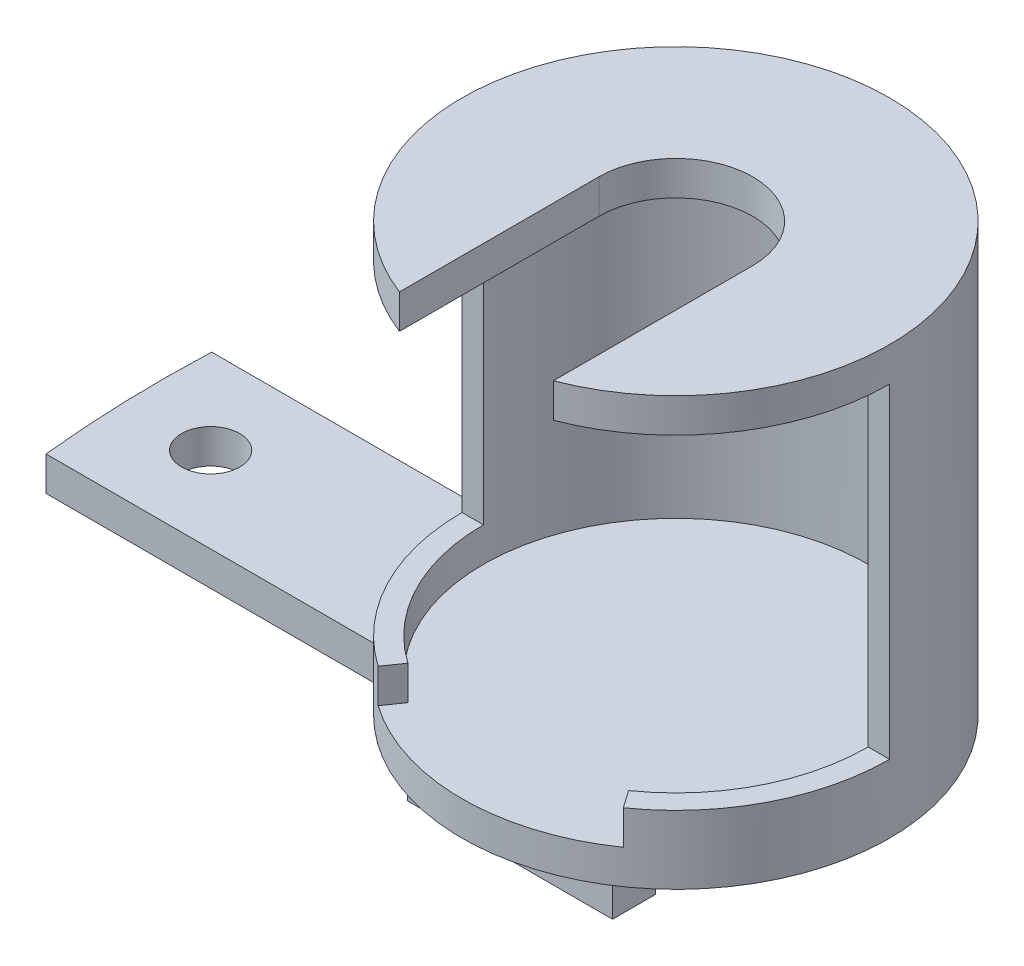
ISO-10303-21;
HEADER;
FILE_DESCRIPTION(('STEP AP214'),'2;1');
FILE_NAME('part.step','',(''),(''),'','','');
FILE_SCHEMA(('AUTOMOTIVE_DESIGN { 1 0 10303 214 1 1 1 1 }'));
ENDSEC;
DATA;
#1=APPLICATION_CONTEXT('core data for automotive mechanical design processes');
#2=APPLICATION_PROTOCOL_DEFINITION('international standard','automotive_design',2000,#1);
#3=PRODUCT_CONTEXT('',#1,'mechanical');
#4=PRODUCT('Part','Part','',(#3));
#5=PRODUCT_RELATED_PRODUCT_CATEGORY('part','',(#4));
#6=PRODUCT_DEFINITION_FORMATION('','',#4);
#7=PRODUCT_DEFINITION_CONTEXT('part definition',#1,'design');
#8=PRODUCT_DEFINITION('design','',#6,#7);
#9=PRODUCT_DEFINITION_SHAPE('','',#8);
#10=(LENGTH_UNIT() NAMED_UNIT(*) SI_UNIT(.MILLI.,.METRE.));
#11=(NAMED_UNIT(*) PLANE_ANGLE_UNIT() SI_UNIT($,.RADIAN.));
#12=(NAMED_UNIT(*) SI_UNIT($,.STERADIAN.) SOLID_ANGLE_UNIT());
#13=UNCERTAINTY_MEASURE_WITH_UNIT(LENGTH_MEASURE(1.E-05),#10,'distance_accuracy_value','');
#14=(GEOMETRIC_REPRESENTATION_CONTEXT(3) GLOBAL_UNCERTAINTY_ASSIGNED_CONTEXT((#13)) GLOBAL_UNIT_ASSIGNED_CONTEXT((#10,
#11,#12)) REPRESENTATION_CONTEXT('',''));
#15=CARTESIAN_POINT('',(0.,0.,0.));
#16=DIRECTION('',(0.,0.,1.));
#17=DIRECTION('',(1.,0.,0.));
#18=AXIS2_PLACEMENT_3D('',#15,#16,#17);
#19=CARTESIAN_POINT('',(0.,-2.,0.));
#20=DIRECTION('',(0.,-1.,0.));
#21=DIRECTION('',(0.,0.,-1.));
#22=AXIS2_PLACEMENT_3D('',#19,#20,#21);
#23=PLANE('',#22);
#24=CARTESIAN_POINT('',(0.,-2.,0.));
#25=DIRECTION('',(0.,-1.,0.));
#26=DIRECTION('',(0.,0.,-1.));
#27=AXIS2_PLACEMENT_3D('',#24,#25,#26);
#28=CIRCLE('',#27,12.5);
#29=CARTESIAN_POINT('',(-12.1823643025482,-2.,-2.8));
#30=VERTEX_POINT('',#29);
#31=CARTESIAN_POINT('',(-10.2181211580212,-2.00000000000001,7.2));
#32=VERTEX_POINT('',#31);
#33=EDGE_CURVE('E395',#30,#32,#28,.T.);
#34=ORIENTED_EDGE('',*,*,#33,.T.);
#35=DIRECTION('',(1.,0.,0.));
#36=VECTOR('',#35,1.);
#37=CARTESIAN_POINT('',(-29.6287297026163,-2.,7.2));
#38=LINE('',#37,#36);
#39=CARTESIAN_POINT('',(-29.6287297026163,-2.,7.2));
#40=VERTEX_POINT('',#39);
#41=EDGE_CURVE('E300',#40,#32,#38,.T.);
#42=ORIENTED_EDGE('',*,*,#41,.F.);
#43=CARTESIAN_POINT('',(40.,-2.,0.));
#44=DIRECTION('',(0.,-1.,0.));
#45=DIRECTION('',(0.,0.,-1.));
#46=AXIS2_PLACEMENT_3D('',#43,#44,#45);
#47=CIRCLE('',#46,70.);
#48=CARTESIAN_POINT('',(-29.9439775820621,-2.,-2.8));
#49=VERTEX_POINT('',#48);
#50=EDGE_CURVE('E274',#49,#40,#47,.F.);
#51=ORIENTED_EDGE('',*,*,#50,.F.);
#52=DIRECTION('',(-1.,0.,0.));
#53=VECTOR('',#52,1.);
#54=CARTESIAN_POINT('',(-29.9439775820621,-2.,-2.8));
#55=LINE('',#54,#53);
#56=EDGE_CURVE('E308',#30,#49,#55,.T.);
#57=ORIENTED_EDGE('',*,*,#56,.F.);
#58=EDGE_LOOP('',(#34,#42,#51,#57));
#59=FACE_BOUND('',#58,.T.);
#60=CARTESIAN_POINT('',(-25.,-2.,2.2));
#61=DIRECTION('',(0.,-1.,0.));
#62=DIRECTION('',(0.,0.,-1.));
#63=AXIS2_PLACEMENT_3D('',#60,#61,#62);
#64=CIRCLE('',#63,1.7);
#65=CARTESIAN_POINT('',(-25.,-2.,0.5));
#66=VERTEX_POINT('',#65);
#67=EDGE_CURVE('E279',#66,#66,#64,.F.);
#68=ORIENTED_EDGE('',*,*,#67,.T.);
#69=EDGE_LOOP('',(#68));
#70=FACE_BOUND('',#69,.T.);
#71=DIRECTION('',(-1.,0.,0.));
#72=VECTOR('',#71,1.);
#73=CARTESIAN_POINT('',(-6.,-2.,9.7));
#74=LINE('',#73,#72);
#75=CARTESIAN_POINT('',(6.,-2.,9.7));
#76=VERTEX_POINT('',#75);
#77=CARTESIAN_POINT('',(-6.,-2.,9.7));
#78=VERTEX_POINT('',#77);
#79=EDGE_CURVE('E235',#76,#78,#74,.T.);
#80=ORIENTED_EDGE('',*,*,#79,.F.);
#81=DIRECTION('',(0.,0.,1.));
#82=VECTOR('',#81,1.);
#83=CARTESIAN_POINT('',(6.,-2.,9.7));
#84=LINE('',#83,#82);
#85=CARTESIAN_POINT('',(6.,-2.,7.2));
#86=VERTEX_POINT('',#85);
#87=EDGE_CURVE('E230',#86,#76,#84,.T.);
#88=ORIENTED_EDGE('',*,*,#87,.F.);
#89=DIRECTION('',(1.,0.,0.));
#90=VECTOR('',#89,1.);
#91=CARTESIAN_POINT('',(-6.,-2.,7.2));
#92=LINE('',#91,#90);
#93=CARTESIAN_POINT('',(-6.,-2.,7.2));
#94=VERTEX_POINT('',#93);
#95=EDGE_CURVE('E245',#94,#86,#92,.T.);
#96=ORIENTED_EDGE('',*,*,#95,.F.);
#97=DIRECTION('',(0.,0.,-1.));
#98=VECTOR('',#97,1.);
#99=CARTESIAN_POINT('',(-6.,-2.,9.7));
#100=LINE('',#99,#98);
#101=EDGE_CURVE('E257',#78,#94,#100,.T.);
#102=ORIENTED_EDGE('',*,*,#101,.F.);
#103=EDGE_LOOP('',(#80,#88,#96,#102));
#104=FACE_BOUND('',#103,.T.);
#105=DIRECTION('',(-1.,0.,0.));
#106=VECTOR('',#105,1.);
#107=CARTESIAN_POINT('',(-6.,-2.,-2.8));
#108=LINE('',#107,#106);
#109=CARTESIAN_POINT('',(6.,-2.,-2.8));
#110=VERTEX_POINT('',#109);
#111=CARTESIAN_POINT('',(-6.,-2.,-2.8));
#112=VERTEX_POINT('',#111);
#113=EDGE_CURVE('E755',#110,#112,#108,.T.);
#114=ORIENTED_EDGE('',*,*,#113,.F.);
#115=DIRECTION('',(0.,0.,1.));
#116=VECTOR('',#115,1.);
#117=CARTESIAN_POINT('',(6.,-2.,-2.8));
#118=LINE('',#117,#116);
#119=CARTESIAN_POINT('',(6.,-2.,-5.3));
#120=VERTEX_POINT('',#119);
#121=EDGE_CURVE('E227',#120,#110,#118,.T.);
#122=ORIENTED_EDGE('',*,*,#121,.F.);
#123=DIRECTION('',(1.,0.,0.));
#124=VECTOR('',#123,1.);
#125=CARTESIAN_POINT('',(-6.,-2.,-5.3));
#126=LINE('',#125,#124);
#127=CARTESIAN_POINT('',(-6.,-2.,-5.3));
#128=VERTEX_POINT('',#127);
#129=EDGE_CURVE('E223',#128,#120,#126,.T.);
#130=ORIENTED_EDGE('',*,*,#129,.F.);
#131=DIRECTION('',(0.,0.,-1.));
#132=VECTOR('',#131,1.);
#133=CARTESIAN_POINT('',(-6.,-2.,-2.8));
#134=LINE('',#133,#132);
#135=EDGE_CURVE('E751',#112,#128,#134,.T.);
#136=ORIENTED_EDGE('',*,*,#135,.F.);
#137=EDGE_LOOP('',(#114,#122,#130,#136));
#138=FACE_BOUND('',#137,.T.);
#139=ADVANCED_FACE('F39',(#59,#70,#104,#138),#23,.T.);
#140=CARTESIAN_POINT('',(0.,2.,0.));
#141=DIRECTION('',(0.,1.,0.));
#142=DIRECTION('',(0.,0.,1.));
#143=AXIS2_PLACEMENT_3D('',#140,#141,#142);
#144=PLANE('',#143);
#145=DIRECTION('',(-0.573576436351047,0.,0.819152044288991));
#146=VECTOR('',#145,1.);
#147=CARTESIAN_POINT('',(0.,2.,0.));
#148=LINE('',#147,#146);
#149=CARTESIAN_POINT('',(-6.45273490894928,2.,9.21546049825115));
#150=VERTEX_POINT('',#149);
#151=CARTESIAN_POINT('',(-7.16970545438809,2.,10.2394005536124));
#152=VERTEX_POINT('',#151);
#153=EDGE_CURVE('E322',#150,#152,#148,.T.);
#154=ORIENTED_EDGE('',*,*,#153,.F.);
#155=CARTESIAN_POINT('',(0.,2.,0.));
#156=DIRECTION('',(0.,1.,0.));
#157=DIRECTION('',(0.,0.,1.));
#158=AXIS2_PLACEMENT_3D('',#155,#156,#157);
#159=CIRCLE('',#158,11.25);
#160=CARTESIAN_POINT('',(-11.25,2.,0.));
#161=VERTEX_POINT('',#160);
#162=EDGE_CURVE('E431',#161,#150,#159,.T.);
#163=ORIENTED_EDGE('',*,*,#162,.F.);
#164=DIRECTION('',(-1.,0.,0.));
#165=VECTOR('',#164,1.);
#166=CARTESIAN_POINT('',(-12.5,2.,0.));
#167=LINE('',#166,#165);
#168=CARTESIAN_POINT('',(-12.5,2.,0.));
#169=VERTEX_POINT('',#168);
#170=EDGE_CURVE('E404',#161,#169,#167,.T.);
#171=ORIENTED_EDGE('',*,*,#170,.T.);
#172=CARTESIAN_POINT('',(0.,2.,0.));
#173=DIRECTION('',(0.,1.,0.));
#174=DIRECTION('',(0.,0.,1.));
#175=AXIS2_PLACEMENT_3D('',#172,#173,#174);
#176=CIRCLE('',#175,12.5);
#177=EDGE_CURVE('E400',#169,#152,#176,.T.);
#178=ORIENTED_EDGE('',*,*,#177,.T.);
#179=EDGE_LOOP('',(#154,#163,#171,#178));
#180=FACE_BOUND('',#179,.T.);
#181=ADVANCED_FACE('F493',(#180),#144,.T.);
#182=CARTESIAN_POINT('',(0.,21.,0.));
#183=DIRECTION('',(0.,-1.,0.));
#184=DIRECTION('',(0.,0.,-1.));
#185=AXIS2_PLACEMENT_3D('',#182,#183,#184);
#186=CYLINDRICAL_SURFACE('',#185,12.5);
#187=ORIENTED_EDGE('',*,*,#33,.F.);
#188=DIRECTION('',(0.,1.,0.));
#189=VECTOR('',#188,1.);
#190=CARTESIAN_POINT('',(-12.1823643025482,-24.1658009221126,-2.8));
#191=LINE('',#190,#189);
#192=CARTESIAN_POINT('',(-12.1823643025482,0.,-2.8));
#193=VERTEX_POINT('',#192);
#194=EDGE_CURVE('E303',#30,#193,#191,.T.);
#195=ORIENTED_EDGE('',*,*,#194,.T.);
#196=CARTESIAN_POINT('',(0.,0.,0.));
#197=DIRECTION('',(0.,-1.,0.));
#198=DIRECTION('',(0.,0.,1.));
#199=AXIS2_PLACEMENT_3D('',#196,#197,#198);
#200=CIRCLE('',#199,12.5);
#201=CARTESIAN_POINT('',(-10.2181211580212,0.,7.2));
#202=VERTEX_POINT('',#201);
#203=EDGE_CURVE('E280',#202,#193,#200,.T.);
#204=ORIENTED_EDGE('',*,*,#203,.F.);
#205=DIRECTION('',(0.,1.,0.));
#206=VECTOR('',#205,1.);
#207=CARTESIAN_POINT('',(-10.2181211580212,-24.1658009221126,7.2));
#208=LINE('',#207,#206);
#209=EDGE_CURVE('E295',#32,#202,#208,.T.);
#210=ORIENTED_EDGE('',*,*,#209,.F.);
#211=EDGE_LOOP('',(#187,#195,#204,#210));
#212=FACE_BOUND('',#211,.T.);
#213=CARTESIAN_POINT('',(0.,0.,0.));
#214=DIRECTION('',(0.,-1.,0.));
#215=DIRECTION('',(0.,0.,-1.));
#216=AXIS2_PLACEMENT_3D('',#213,#214,#215);
#217=CIRCLE('',#216,12.5);
#218=CARTESIAN_POINT('',(-7.16970545438809,0.,10.2394005536124));
#219=VERTEX_POINT('',#218);
#220=CARTESIAN_POINT('',(7.1697054543881,0.,10.2394005536124));
#221=VERTEX_POINT('',#220);
#222=EDGE_CURVE('E337',#219,#221,#217,.F.);
#223=ORIENTED_EDGE('',*,*,#222,.F.);
#224=DIRECTION('',(0.,1.,0.));
#225=VECTOR('',#224,1.);
#226=CARTESIAN_POINT('',(-7.16970545438809,-19.0228469270698,10.2394005536124));
#227=LINE('',#226,#225);
#228=EDGE_CURVE('E330',#219,#152,#227,.T.);
#229=ORIENTED_EDGE('',*,*,#228,.T.);
#230=ORIENTED_EDGE('',*,*,#177,.F.);
#231=DIRECTION('',(0.,1.,0.));
#232=VECTOR('',#231,1.);
#233=CARTESIAN_POINT('',(-12.5,2.,0.));
#234=LINE('',#233,#232);
#235=CARTESIAN_POINT('',(-12.5,21.,0.));
#236=VERTEX_POINT('',#235);
#237=EDGE_CURVE('E415',#169,#236,#234,.T.);
#238=ORIENTED_EDGE('',*,*,#237,.T.);
#239=CARTESIAN_POINT('',(0.,21.,0.));
#240=DIRECTION('',(0.,1.,0.));
#241=DIRECTION('',(0.,0.,1.));
#242=AXIS2_PLACEMENT_3D('',#239,#240,#241);
#243=CIRCLE('',#242,12.5);
#244=CARTESIAN_POINT('',(-4.5,21.,11.6619037896906));
#245=VERTEX_POINT('',#244);
#246=EDGE_CURVE('E373',#236,#245,#243,.T.);
#247=ORIENTED_EDGE('',*,*,#246,.T.);
#248=DIRECTION('',(0.,-1.,0.));
#249=VECTOR('',#248,1.);
#250=CARTESIAN_POINT('',(-4.5,23.,11.6619037896906));
#251=LINE('',#250,#249);
#252=CARTESIAN_POINT('',(-4.5,23.,11.6619037896906));
#253=VERTEX_POINT('',#252);
#254=EDGE_CURVE('E383',#253,#245,#251,.T.);
#255=ORIENTED_EDGE('',*,*,#254,.F.);
#256=CARTESIAN_POINT('',(0.,23.,0.));
#257=DIRECTION('',(0.,1.,0.));
#258=DIRECTION('',(0.,0.,1.));
#259=AXIS2_PLACEMENT_3D('',#256,#257,#258);
#260=CIRCLE('',#259,12.5);
#261=CARTESIAN_POINT('',(4.5,23.,11.6619037896906));
#262=VERTEX_POINT('',#261);
#263=EDGE_CURVE('E360',#262,#253,#260,.T.);
#264=ORIENTED_EDGE('',*,*,#263,.F.);
#265=DIRECTION('',(0.,-1.,0.));
#266=VECTOR('',#265,1.);
#267=CARTESIAN_POINT('',(4.5,23.,11.6619037896906));
#268=LINE('',#267,#266);
#269=CARTESIAN_POINT('',(4.5,21.,11.6619037896906));
#270=VERTEX_POINT('',#269);
#271=EDGE_CURVE('E387',#262,#270,#268,.T.);
#272=ORIENTED_EDGE('',*,*,#271,.T.);
#273=CARTESIAN_POINT('',(12.5,21.,0.));
#274=VERTEX_POINT('',#273);
#275=EDGE_CURVE('E374',#270,#274,#243,.T.);
#276=ORIENTED_EDGE('',*,*,#275,.T.);
#277=DIRECTION('',(0.,1.,0.));
#278=VECTOR('',#277,1.);
#279=CARTESIAN_POINT('',(12.5,2.,0.));
#280=LINE('',#279,#278);
#281=CARTESIAN_POINT('',(12.5,2.,0.));
#282=VERTEX_POINT('',#281);
#283=EDGE_CURVE('E410',#282,#274,#280,.T.);
#284=ORIENTED_EDGE('',*,*,#283,.F.);
#285=CARTESIAN_POINT('',(7.16970545438809,2.,10.2394005536124));
#286=VERTEX_POINT('',#285);
#287=EDGE_CURVE('E405',#286,#282,#176,.T.);
#288=ORIENTED_EDGE('',*,*,#287,.F.);
#289=DIRECTION('',(0.,1.,0.));
#290=VECTOR('',#289,1.);
#291=CARTESIAN_POINT('',(7.1697054543881,-19.0228469270698,10.2394005536124));
#292=LINE('',#291,#290);
#293=EDGE_CURVE('E336',#221,#286,#292,.T.);
#294=ORIENTED_EDGE('',*,*,#293,.F.);
#295=EDGE_LOOP('',(#223,#229,#230,#238,#247,#255,#264,#272,#276,#284,#288,#294));
#296=FACE_BOUND('',#295,.T.);
#297=ADVANCED_FACE('F41',(#212,#296),#186,.T.);
#298=CARTESIAN_POINT('',(0.,21.,0.));
#299=DIRECTION('',(0.,-1.,0.));
#300=DIRECTION('',(0.,0.,-1.));
#301=AXIS2_PLACEMENT_3D('',#298,#299,#300);
#302=CYLINDRICAL_SURFACE('',#301,11.25);
#303=DIRECTION('',(0.,-1.,0.));
#304=VECTOR('',#303,1.);
#305=CARTESIAN_POINT('',(-6.45273490894928,21.,9.21546049825115));
#306=LINE('',#305,#304);
#307=CARTESIAN_POINT('',(-6.45273490894929,0.,9.21546049825115));
#308=VERTEX_POINT('',#307);
#309=EDGE_CURVE('E348',#308,#150,#306,.F.);
#310=ORIENTED_EDGE('',*,*,#309,.F.);
#311=CARTESIAN_POINT('',(0.,0.,0.));
#312=DIRECTION('',(0.,1.,0.));
#313=DIRECTION('',(0.,0.,1.));
#314=AXIS2_PLACEMENT_3D('',#311,#312,#313);
#315=CIRCLE('',#314,11.25);
#316=CARTESIAN_POINT('',(6.45273490894929,0.,9.21546049825115));
#317=VERTEX_POINT('',#316);
#318=EDGE_CURVE('E419',#317,#308,#315,.T.);
#319=ORIENTED_EDGE('',*,*,#318,.F.);
#320=DIRECTION('',(0.,-1.,0.));
#321=VECTOR('',#320,1.);
#322=CARTESIAN_POINT('',(6.45273490894928,21.,9.21546049825115));
#323=LINE('',#322,#321);
#324=CARTESIAN_POINT('',(6.45273490894928,2.,9.21546049825115));
#325=VERTEX_POINT('',#324);
#326=EDGE_CURVE('E335',#325,#317,#323,.T.);
#327=ORIENTED_EDGE('',*,*,#326,.F.);
#328=CARTESIAN_POINT('',(11.25,2.,0.));
#329=VERTEX_POINT('',#328);
#330=EDGE_CURVE('E427',#325,#329,#159,.T.);
#331=ORIENTED_EDGE('',*,*,#330,.T.);
#332=DIRECTION('',(0.,-1.,0.));
#333=VECTOR('',#332,1.);
#334=CARTESIAN_POINT('',(11.25,21.,0.));
#335=LINE('',#334,#333);
#336=CARTESIAN_POINT('',(11.25,21.,0.));
#337=VERTEX_POINT('',#336);
#338=EDGE_CURVE('E11',#337,#329,#335,.T.);
#339=ORIENTED_EDGE('',*,*,#338,.F.);
#340=CARTESIAN_POINT('',(0.,21.,0.));
#341=DIRECTION('',(0.,1.,0.));
#342=DIRECTION('',(0.,0.,1.));
#343=AXIS2_PLACEMENT_3D('',#340,#341,#342);
#344=CIRCLE('',#343,11.25);
#345=CARTESIAN_POINT('',(-11.25,21.,0.));
#346=VERTEX_POINT('',#345);
#347=EDGE_CURVE('E423',#337,#346,#344,.T.);
#348=ORIENTED_EDGE('',*,*,#347,.T.);
#349=DIRECTION('',(0.,-1.,0.));
#350=VECTOR('',#349,1.);
#351=CARTESIAN_POINT('',(-11.25,21.,0.));
#352=LINE('',#351,#350);
#353=EDGE_CURVE('E48',#161,#346,#352,.F.);
#354=ORIENTED_EDGE('',*,*,#353,.F.);
#355=ORIENTED_EDGE('',*,*,#162,.T.);
#356=EDGE_LOOP('',(#310,#319,#327,#331,#339,#348,#354,#355));
#357=FACE_BOUND('',#356,.T.);
#358=ADVANCED_FACE('F445',(#357),#302,.F.);
#359=CARTESIAN_POINT('',(-12.5,2.,0.));
#360=DIRECTION('',(0.,0.,-1.));
#361=DIRECTION('',(-1.,0.,0.));
#362=AXIS2_PLACEMENT_3D('',#359,#360,#361);
#363=PLANE('',#362);
#364=ORIENTED_EDGE('',*,*,#338,.T.);
#365=EDGE_CURVE('E406',#282,#329,#167,.T.);
#366=ORIENTED_EDGE('',*,*,#365,.F.);
#367=ORIENTED_EDGE('',*,*,#283,.T.);
#368=DIRECTION('',(-1.,0.,0.));
#369=VECTOR('',#368,1.);
#370=CARTESIAN_POINT('',(-12.5,21.,0.));
#371=LINE('',#370,#369);
#372=EDGE_CURVE('E411',#274,#337,#371,.T.);
#373=ORIENTED_EDGE('',*,*,#372,.T.);
#374=EDGE_LOOP('',(#364,#366,#367,#373));
#375=FACE_BOUND('',#374,.T.);
#376=ADVANCED_FACE('F450',(#375),#363,.F.);
#377=ORIENTED_EDGE('',*,*,#353,.T.);
#378=EDGE_CURVE('E399',#346,#236,#371,.T.);
#379=ORIENTED_EDGE('',*,*,#378,.T.);
#380=ORIENTED_EDGE('',*,*,#237,.F.);
#381=ORIENTED_EDGE('',*,*,#170,.F.);
#382=EDGE_LOOP('',(#377,#379,#380,#381));
#383=FACE_BOUND('',#382,.T.);
#384=ADVANCED_FACE('F440',(#383),#363,.F.);
#385=DIRECTION('',(-0.573576436351047,0.,-0.819152044288991));
#386=VECTOR('',#385,1.);
#387=CARTESIAN_POINT('',(0.,2.,0.));
#388=LINE('',#387,#386);
#389=EDGE_CURVE('E299',#286,#325,#388,.T.);
#390=ORIENTED_EDGE('',*,*,#389,.F.);
#391=ORIENTED_EDGE('',*,*,#287,.T.);
#392=ORIENTED_EDGE('',*,*,#365,.T.);
#393=ORIENTED_EDGE('',*,*,#330,.F.);
#394=EDGE_LOOP('',(#390,#391,#392,#393));
#395=FACE_BOUND('',#394,.T.);
#396=ADVANCED_FACE('F482',(#395),#144,.T.);
#397=CARTESIAN_POINT('',(0.,0.,0.));
#398=DIRECTION('',(0.,-1.,0.));
#399=DIRECTION('',(0.,0.,-1.));
#400=AXIS2_PLACEMENT_3D('',#397,#398,#399);
#401=PLANE('',#400);
#402=ORIENTED_EDGE('',*,*,#318,.T.);
#403=DIRECTION('',(-0.573576436351047,0.,0.819152044288991));
#404=VECTOR('',#403,1.);
#405=CARTESIAN_POINT('',(0.,0.,0.));
#406=LINE('',#405,#404);
#407=EDGE_CURVE('E325',#308,#219,#406,.T.);
#408=ORIENTED_EDGE('',*,*,#407,.T.);
#409=ORIENTED_EDGE('',*,*,#222,.T.);
#410=DIRECTION('',(-0.573576436351047,0.,-0.819152044288991));
#411=VECTOR('',#410,1.);
#412=CARTESIAN_POINT('',(0.,0.,0.));
#413=LINE('',#412,#411);
#414=EDGE_CURVE('E331',#221,#317,#413,.T.);
#415=ORIENTED_EDGE('',*,*,#414,.T.);
#416=EDGE_LOOP('',(#402,#408,#409,#415));
#417=FACE_BOUND('',#416,.T.);
#418=ADVANCED_FACE('F488',(#417),#401,.F.);
#419=CARTESIAN_POINT('',(0.,21.,0.));
#420=DIRECTION('',(0.,1.,0.));
#421=DIRECTION('',(0.,0.,1.));
#422=AXIS2_PLACEMENT_3D('',#419,#420,#421);
#423=PLANE('',#422);
#424=ORIENTED_EDGE('',*,*,#372,.F.);
#425=ORIENTED_EDGE('',*,*,#275,.F.);
#426=DIRECTION('',(0.,0.,1.));
#427=VECTOR('',#426,1.);
#428=CARTESIAN_POINT('',(4.5,21.,0.));
#429=LINE('',#428,#427);
#430=CARTESIAN_POINT('',(4.5,21.,0.));
#431=VERTEX_POINT('',#430);
#432=EDGE_CURVE('E370',#431,#270,#429,.T.);
#433=ORIENTED_EDGE('',*,*,#432,.F.);
#434=CARTESIAN_POINT('',(0.,21.,0.));
#435=DIRECTION('',(0.,-1.,0.));
#436=DIRECTION('',(0.,0.,1.));
#437=AXIS2_PLACEMENT_3D('',#434,#435,#436);
#438=CIRCLE('',#437,4.5);
#439=CARTESIAN_POINT('',(-4.5,21.,0.));
#440=VERTEX_POINT('',#439);
#441=EDGE_CURVE('E351',#440,#431,#438,.T.);
#442=ORIENTED_EDGE('',*,*,#441,.F.);
#443=DIRECTION('',(0.,0.,-1.));
#444=VECTOR('',#443,1.);
#445=CARTESIAN_POINT('',(-4.5,21.,0.));
#446=LINE('',#445,#444);
#447=EDGE_CURVE('E357',#245,#440,#446,.T.);
#448=ORIENTED_EDGE('',*,*,#447,.F.);
#449=ORIENTED_EDGE('',*,*,#246,.F.);
#450=ORIENTED_EDGE('',*,*,#378,.F.);
#451=ORIENTED_EDGE('',*,*,#347,.F.);
#452=EDGE_LOOP('',(#424,#425,#433,#442,#448,#449,#450,#451));
#453=FACE_BOUND('',#452,.T.);
#454=ADVANCED_FACE('F447',(#453),#423,.F.);
#455=CARTESIAN_POINT('',(0.,23.,0.));
#456=DIRECTION('',(0.,-1.,0.));
#457=DIRECTION('',(0.,0.,-1.));
#458=AXIS2_PLACEMENT_3D('',#455,#456,#457);
#459=CYLINDRICAL_SURFACE('',#458,4.5);
#460=ORIENTED_EDGE('',*,*,#441,.T.);
#461=DIRECTION('',(0.,-1.,0.));
#462=VECTOR('',#461,1.);
#463=CARTESIAN_POINT('',(4.5,23.,0.));
#464=LINE('',#463,#462);
#465=CARTESIAN_POINT('',(4.5,23.,0.));
#466=VERTEX_POINT('',#465);
#467=EDGE_CURVE('E391',#466,#431,#464,.T.);
#468=ORIENTED_EDGE('',*,*,#467,.F.);
#469=CARTESIAN_POINT('',(0.,23.,0.));
#470=DIRECTION('',(0.,-1.,0.));
#471=DIRECTION('',(0.,0.,1.));
#472=AXIS2_PLACEMENT_3D('',#469,#470,#471);
#473=CIRCLE('',#472,4.5);
#474=CARTESIAN_POINT('',(-4.5,23.,0.));
#475=VERTEX_POINT('',#474);
#476=EDGE_CURVE('E352',#475,#466,#473,.T.);
#477=ORIENTED_EDGE('',*,*,#476,.F.);
#478=DIRECTION('',(0.,-1.,0.));
#479=VECTOR('',#478,1.);
#480=CARTESIAN_POINT('',(-4.5,23.,0.));
#481=LINE('',#480,#479);
#482=EDGE_CURVE('E366',#475,#440,#481,.T.);
#483=ORIENTED_EDGE('',*,*,#482,.T.);
#484=EDGE_LOOP('',(#460,#468,#477,#483));
#485=FACE_BOUND('',#484,.T.);
#486=ADVANCED_FACE('F466',(#485),#459,.F.);
#487=CARTESIAN_POINT('',(4.5,23.,0.));
#488=DIRECTION('',(1.,0.,0.));
#489=DIRECTION('',(0.,0.,-1.));
#490=AXIS2_PLACEMENT_3D('',#487,#488,#489);
#491=PLANE('',#490);
#492=ORIENTED_EDGE('',*,*,#432,.T.);
#493=ORIENTED_EDGE('',*,*,#271,.F.);
#494=DIRECTION('',(0.,0.,1.));
#495=VECTOR('',#494,1.);
#496=CARTESIAN_POINT('',(4.5,23.,0.));
#497=LINE('',#496,#495);
#498=EDGE_CURVE('E356',#466,#262,#497,.T.);
#499=ORIENTED_EDGE('',*,*,#498,.F.);
#500=ORIENTED_EDGE('',*,*,#467,.T.);
#501=EDGE_LOOP('',(#492,#493,#499,#500));
#502=FACE_BOUND('',#501,.T.);
#503=ADVANCED_FACE('F463',(#502),#491,.F.);
#504=CARTESIAN_POINT('',(-4.5,23.,0.));
#505=DIRECTION('',(-1.,0.,0.));
#506=DIRECTION('',(0.,0.,1.));
#507=AXIS2_PLACEMENT_3D('',#504,#505,#506);
#508=PLANE('',#507);
#509=ORIENTED_EDGE('',*,*,#447,.T.);
#510=ORIENTED_EDGE('',*,*,#482,.F.);
#511=DIRECTION('',(0.,0.,-1.));
#512=VECTOR('',#511,1.);
#513=CARTESIAN_POINT('',(-4.5,23.,0.));
#514=LINE('',#513,#512);
#515=EDGE_CURVE('E363',#253,#475,#514,.T.);
#516=ORIENTED_EDGE('',*,*,#515,.F.);
#517=ORIENTED_EDGE('',*,*,#254,.T.);
#518=EDGE_LOOP('',(#509,#510,#516,#517));
#519=FACE_BOUND('',#518,.T.);
#520=ADVANCED_FACE('F470',(#519),#508,.F.);
#521=CARTESIAN_POINT('',(0.,23.,0.));
#522=DIRECTION('',(0.,1.,0.));
#523=DIRECTION('',(0.,0.,1.));
#524=AXIS2_PLACEMENT_3D('',#521,#522,#523);
#525=PLANE('',#524);
#526=ORIENTED_EDGE('',*,*,#476,.T.);
#527=ORIENTED_EDGE('',*,*,#498,.T.);
#528=ORIENTED_EDGE('',*,*,#263,.T.);
#529=ORIENTED_EDGE('',*,*,#515,.T.);
#530=EDGE_LOOP('',(#526,#527,#528,#529));
#531=FACE_BOUND('',#530,.T.);
#532=ADVANCED_FACE('F561',(#531),#525,.T.);
#533=CARTESIAN_POINT('',(0.,-19.0228469270698,0.));
#534=DIRECTION('',(-0.819152044288991,0.,-0.573576436351047));
#535=DIRECTION('',(-0.573576436351047,0.,0.819152044288991));
#536=AXIS2_PLACEMENT_3D('',#533,#534,#535);
#537=PLANE('',#536);
#538=ORIENTED_EDGE('',*,*,#309,.T.);
#539=ORIENTED_EDGE('',*,*,#153,.T.);
#540=ORIENTED_EDGE('',*,*,#228,.F.);
#541=ORIENTED_EDGE('',*,*,#407,.F.);
#542=EDGE_LOOP('',(#538,#539,#540,#541));
#543=FACE_BOUND('',#542,.T.);
#544=ADVANCED_FACE('F490',(#543),#537,.F.);
#545=CARTESIAN_POINT('',(0.,-19.0228469270698,0.));
#546=DIRECTION('',(0.819152044288991,0.,-0.573576436351047));
#547=DIRECTION('',(-0.573576436351047,0.,-0.819152044288991));
#548=AXIS2_PLACEMENT_3D('',#545,#546,#547);
#549=PLANE('',#548);
#550=ORIENTED_EDGE('',*,*,#326,.T.);
#551=ORIENTED_EDGE('',*,*,#414,.F.);
#552=ORIENTED_EDGE('',*,*,#293,.T.);
#553=ORIENTED_EDGE('',*,*,#389,.T.);
#554=EDGE_LOOP('',(#550,#551,#552,#553));
#555=FACE_BOUND('',#554,.T.);
#556=ADVANCED_FACE('F484',(#555),#549,.F.);
#557=CARTESIAN_POINT('',(40.,-24.1658009221126,0.));
#558=DIRECTION('',(0.,1.,0.));
#559=DIRECTION('',(0.,0.,1.));
#560=AXIS2_PLACEMENT_3D('',#557,#558,#559);
#561=CYLINDRICAL_SURFACE('',#560,70.);
#562=DIRECTION('',(0.,1.,0.));
#563=VECTOR('',#562,1.);
#564=CARTESIAN_POINT('',(-29.9439775820621,-24.1658009221126,-2.8));
#565=LINE('',#564,#563);
#566=CARTESIAN_POINT('',(-29.9439775820621,0.,-2.8));
#567=VERTEX_POINT('',#566);
#568=EDGE_CURVE('E312',#49,#567,#565,.T.);
#569=ORIENTED_EDGE('',*,*,#568,.F.);
#570=ORIENTED_EDGE('',*,*,#50,.T.);
#571=DIRECTION('',(0.,1.,0.));
#572=VECTOR('',#571,1.);
#573=CARTESIAN_POINT('',(-29.6287297026163,-24.1658009221126,7.2));
#574=LINE('',#573,#572);
#575=CARTESIAN_POINT('',(-29.6287297026163,0.,7.2));
#576=VERTEX_POINT('',#575);
#577=EDGE_CURVE('E307',#40,#576,#574,.T.);
#578=ORIENTED_EDGE('',*,*,#577,.T.);
#579=CARTESIAN_POINT('',(40.,0.,0.));
#580=DIRECTION('',(0.,1.,0.));
#581=DIRECTION('',(0.,0.,1.));
#582=AXIS2_PLACEMENT_3D('',#579,#580,#581);
#583=CIRCLE('',#582,70.);
#584=EDGE_CURVE('E287',#567,#576,#583,.T.);
#585=ORIENTED_EDGE('',*,*,#584,.F.);
#586=EDGE_LOOP('',(#569,#570,#578,#585));
#587=FACE_BOUND('',#586,.T.);
#588=ADVANCED_FACE('F600',(#587),#561,.T.);
#589=CARTESIAN_POINT('',(-29.9439775820621,-24.1658009221126,-2.8));
#590=DIRECTION('',(0.,0.,-1.));
#591=DIRECTION('',(-1.,0.,0.));
#592=AXIS2_PLACEMENT_3D('',#589,#590,#591);
#593=PLANE('',#592);
#594=ORIENTED_EDGE('',*,*,#194,.F.);
#595=ORIENTED_EDGE('',*,*,#56,.T.);
#596=ORIENTED_EDGE('',*,*,#568,.T.);
#597=DIRECTION('',(-1.,0.,0.));
#598=VECTOR('',#597,1.);
#599=CARTESIAN_POINT('',(-29.9439775820621,0.,-2.8));
#600=LINE('',#599,#598);
#601=EDGE_CURVE('E275',#193,#567,#600,.T.);
#602=ORIENTED_EDGE('',*,*,#601,.F.);
#603=EDGE_LOOP('',(#594,#595,#596,#602));
#604=FACE_BOUND('',#603,.T.);
#605=ADVANCED_FACE('F608',(#604),#593,.T.);
#606=CARTESIAN_POINT('',(-29.6287297026163,-24.1658009221126,7.2));
#607=DIRECTION('',(0.,0.,1.));
#608=DIRECTION('',(1.,0.,0.));
#609=AXIS2_PLACEMENT_3D('',#606,#607,#608);
#610=PLANE('',#609);
#611=ORIENTED_EDGE('',*,*,#577,.F.);
#612=ORIENTED_EDGE('',*,*,#41,.T.);
#613=ORIENTED_EDGE('',*,*,#209,.T.);
#614=DIRECTION('',(1.,0.,0.));
#615=VECTOR('',#614,1.);
#616=CARTESIAN_POINT('',(-29.6287297026163,0.,7.2));
#617=LINE('',#616,#615);
#618=EDGE_CURVE('E283',#576,#202,#617,.T.);
#619=ORIENTED_EDGE('',*,*,#618,.F.);
#620=EDGE_LOOP('',(#611,#612,#613,#619));
#621=FACE_BOUND('',#620,.T.);
#622=ADVANCED_FACE('F617',(#621),#610,.T.);
#623=CARTESIAN_POINT('',(-25.,-24.1658009221126,2.2));
#624=DIRECTION('',(0.,1.,0.));
#625=DIRECTION('',(0.,0.,1.));
#626=AXIS2_PLACEMENT_3D('',#623,#624,#625);
#627=CYLINDRICAL_SURFACE('',#626,1.7);
#628=CARTESIAN_POINT('',(-25.,0.,2.2));
#629=DIRECTION('',(0.,1.,0.));
#630=DIRECTION('',(0.,0.,1.));
#631=AXIS2_PLACEMENT_3D('',#628,#629,#630);
#632=CIRCLE('',#631,1.7);
#633=CARTESIAN_POINT('',(-25.,0.,3.9));
#634=VERTEX_POINT('',#633);
#635=EDGE_CURVE('E291',#634,#634,#632,.T.);
#636=ORIENTED_EDGE('',*,*,#635,.T.);
#637=EDGE_LOOP('',(#636));
#638=FACE_BOUND('',#637,.T.);
#639=ORIENTED_EDGE('',*,*,#67,.F.);
#640=EDGE_LOOP('',(#639));
#641=FACE_BOUND('',#640,.T.);
#642=ADVANCED_FACE('F626',(#638,#641),#627,.F.);
#643=CARTESIAN_POINT('',(40.,0.,0.));
#644=DIRECTION('',(0.,1.,0.));
#645=DIRECTION('',(0.,0.,1.));
#646=AXIS2_PLACEMENT_3D('',#643,#644,#645);
#647=PLANE('',#646);
#648=ORIENTED_EDGE('',*,*,#635,.F.);
#649=EDGE_LOOP('',(#648));
#650=FACE_BOUND('',#649,.T.);
#651=ORIENTED_EDGE('',*,*,#584,.T.);
#652=ORIENTED_EDGE('',*,*,#618,.T.);
#653=ORIENTED_EDGE('',*,*,#203,.T.);
#654=ORIENTED_EDGE('',*,*,#601,.T.);
#655=EDGE_LOOP('',(#651,#652,#653,#654));
#656=FACE_BOUND('',#655,.T.);
#657=ADVANCED_FACE('F635',(#650,#656),#647,.T.);
#658=CARTESIAN_POINT('',(6.,-4.5,9.7));
#659=DIRECTION('',(-1.,0.,0.));
#660=DIRECTION('',(0.,0.,1.));
#661=AXIS2_PLACEMENT_3D('',#658,#659,#660);
#662=PLANE('',#661);
#663=ORIENTED_EDGE('',*,*,#87,.T.);
#664=DIRECTION('',(0.,1.,0.));
#665=VECTOR('',#664,1.);
#666=CARTESIAN_POINT('',(6.,-4.5,9.7));
#667=LINE('',#666,#665);
#668=CARTESIAN_POINT('',(6.,-4.5,9.7));
#669=VERTEX_POINT('',#668);
#670=EDGE_CURVE('E271',#669,#76,#667,.T.);
#671=ORIENTED_EDGE('',*,*,#670,.F.);
#672=DIRECTION('',(0.,0.,1.));
#673=VECTOR('',#672,1.);
#674=CARTESIAN_POINT('',(6.,-4.5,9.7));
#675=LINE('',#674,#673);
#676=CARTESIAN_POINT('',(6.,-4.5,7.2));
#677=VERTEX_POINT('',#676);
#678=EDGE_CURVE('E240',#677,#669,#675,.T.);
#679=ORIENTED_EDGE('',*,*,#678,.F.);
#680=DIRECTION('',(0.,1.,0.));
#681=VECTOR('',#680,1.);
#682=CARTESIAN_POINT('',(6.,-4.5,7.2));
#683=LINE('',#682,#681);
#684=EDGE_CURVE('E253',#677,#86,#683,.T.);
#685=ORIENTED_EDGE('',*,*,#684,.T.);
#686=EDGE_LOOP('',(#663,#671,#679,#685));
#687=FACE_BOUND('',#686,.T.);
#688=ADVANCED_FACE('F644',(#687),#662,.F.);
#689=CARTESIAN_POINT('',(-6.,-4.5,9.7));
#690=DIRECTION('',(0.,0.,-1.));
#691=DIRECTION('',(-1.,0.,0.));
#692=AXIS2_PLACEMENT_3D('',#689,#690,#691);
#693=PLANE('',#692);
#694=ORIENTED_EDGE('',*,*,#79,.T.);
#695=DIRECTION('',(0.,1.,0.));
#696=VECTOR('',#695,1.);
#697=CARTESIAN_POINT('',(-6.,-4.5,9.7));
#698=LINE('',#697,#696);
#699=CARTESIAN_POINT('',(-6.,-4.5,9.7));
#700=VERTEX_POINT('',#699);
#701=EDGE_CURVE('E267',#700,#78,#698,.T.);
#702=ORIENTED_EDGE('',*,*,#701,.F.);
#703=DIRECTION('',(-1.,0.,0.));
#704=VECTOR('',#703,1.);
#705=CARTESIAN_POINT('',(-6.,-4.5,9.7));
#706=LINE('',#705,#704);
#707=EDGE_CURVE('E244',#669,#700,#706,.T.);
#708=ORIENTED_EDGE('',*,*,#707,.F.);
#709=ORIENTED_EDGE('',*,*,#670,.T.);
#710=EDGE_LOOP('',(#694,#702,#708,#709));
#711=FACE_BOUND('',#710,.T.);
#712=ADVANCED_FACE('F661',(#711),#693,.F.);
#713=CARTESIAN_POINT('',(-6.,-4.5,9.7));
#714=DIRECTION('',(1.,0.,0.));
#715=DIRECTION('',(0.,0.,-1.));
#716=AXIS2_PLACEMENT_3D('',#713,#714,#715);
#717=PLANE('',#716);
#718=ORIENTED_EDGE('',*,*,#101,.T.);
#719=DIRECTION('',(0.,1.,0.));
#720=VECTOR('',#719,1.);
#721=CARTESIAN_POINT('',(-6.,-4.5,7.2));
#722=LINE('',#721,#720);
#723=CARTESIAN_POINT('',(-6.,-4.5,7.2));
#724=VERTEX_POINT('',#723);
#725=EDGE_CURVE('E63',#724,#94,#722,.T.);
#726=ORIENTED_EDGE('',*,*,#725,.F.);
#727=DIRECTION('',(0.,0.,-1.));
#728=VECTOR('',#727,1.);
#729=CARTESIAN_POINT('',(-6.,-4.5,9.7));
#730=LINE('',#729,#728);
#731=EDGE_CURVE('E248',#700,#724,#730,.T.);
#732=ORIENTED_EDGE('',*,*,#731,.F.);
#733=ORIENTED_EDGE('',*,*,#701,.T.);
#734=EDGE_LOOP('',(#718,#726,#732,#733));
#735=FACE_BOUND('',#734,.T.);
#736=ADVANCED_FACE('F670',(#735),#717,.F.);
#737=CARTESIAN_POINT('',(-6.,-4.5,7.2));
#738=DIRECTION('',(0.,0.,1.));
#739=DIRECTION('',(1.,0.,0.));
#740=AXIS2_PLACEMENT_3D('',#737,#738,#739);
#741=PLANE('',#740);
#742=ORIENTED_EDGE('',*,*,#95,.T.);
#743=ORIENTED_EDGE('',*,*,#684,.F.);
#744=DIRECTION('',(1.,0.,0.));
#745=VECTOR('',#744,1.);
#746=CARTESIAN_POINT('',(-6.,-4.5,7.2));
#747=LINE('',#746,#745);
#748=EDGE_CURVE('E251',#724,#677,#747,.T.);
#749=ORIENTED_EDGE('',*,*,#748,.F.);
#750=ORIENTED_EDGE('',*,*,#725,.T.);
#751=EDGE_LOOP('',(#742,#743,#749,#750));
#752=FACE_BOUND('',#751,.T.);
#753=ADVANCED_FACE('F679',(#752),#741,.F.);
#754=CARTESIAN_POINT('',(0.,-4.5,0.));
#755=DIRECTION('',(0.,-1.,0.));
#756=DIRECTION('',(0.,0.,-1.));
#757=AXIS2_PLACEMENT_3D('',#754,#755,#756);
#758=PLANE('',#757);
#759=ORIENTED_EDGE('',*,*,#678,.T.);
#760=ORIENTED_EDGE('',*,*,#707,.T.);
#761=ORIENTED_EDGE('',*,*,#731,.T.);
#762=ORIENTED_EDGE('',*,*,#748,.T.);
#763=EDGE_LOOP('',(#759,#760,#761,#762));
#764=FACE_BOUND('',#763,.T.);
#765=ADVANCED_FACE('F688',(#764),#758,.T.);
#766=CARTESIAN_POINT('',(6.,-4.5,-2.8));
#767=DIRECTION('',(-1.,0.,0.));
#768=DIRECTION('',(0.,0.,1.));
#769=AXIS2_PLACEMENT_3D('',#766,#767,#768);
#770=PLANE('',#769);
#771=ORIENTED_EDGE('',*,*,#121,.T.);
#772=DIRECTION('',(0.,1.,0.));
#773=VECTOR('',#772,1.);
#774=CARTESIAN_POINT('',(6.,-4.5,-2.8));
#775=LINE('',#774,#773);
#776=CARTESIAN_POINT('',(6.,-4.5,-2.8));
#777=VERTEX_POINT('',#776);
#778=EDGE_CURVE('E206',#777,#110,#775,.T.);
#779=ORIENTED_EDGE('',*,*,#778,.F.);
#780=DIRECTION('',(0.,0.,1.));
#781=VECTOR('',#780,1.);
#782=CARTESIAN_POINT('',(6.,-4.5,-2.8));
#783=LINE('',#782,#781);
#784=CARTESIAN_POINT('',(6.,-4.5,-5.3));
#785=VERTEX_POINT('',#784);
#786=EDGE_CURVE('E214',#785,#777,#783,.T.);
#787=ORIENTED_EDGE('',*,*,#786,.F.);
#788=DIRECTION('',(0.,1.,0.));
#789=VECTOR('',#788,1.);
#790=CARTESIAN_POINT('',(6.,-4.5,-5.3));
#791=LINE('',#790,#789);
#792=EDGE_CURVE('E747',#785,#120,#791,.T.);
#793=ORIENTED_EDGE('',*,*,#792,.T.);
#794=EDGE_LOOP('',(#771,#779,#787,#793));
#795=FACE_BOUND('',#794,.T.);
#796=ADVANCED_FACE('F225',(#795),#770,.F.);
#797=CARTESIAN_POINT('',(-6.,-4.5,-2.8));
#798=DIRECTION('',(0.,0.,-1.));
#799=DIRECTION('',(-1.,0.,0.));
#800=AXIS2_PLACEMENT_3D('',#797,#798,#799);
#801=PLANE('',#800);
#802=ORIENTED_EDGE('',*,*,#113,.T.);
#803=DIRECTION('',(0.,1.,0.));
#804=VECTOR('',#803,1.);
#805=CARTESIAN_POINT('',(-6.,-4.5,-2.8));
#806=LINE('',#805,#804);
#807=CARTESIAN_POINT('',(-6.,-4.5,-2.8));
#808=VERTEX_POINT('',#807);
#809=EDGE_CURVE('E209',#808,#112,#806,.T.);
#810=ORIENTED_EDGE('',*,*,#809,.F.);
#811=DIRECTION('',(-1.,0.,0.));
#812=VECTOR('',#811,1.);
#813=CARTESIAN_POINT('',(-6.,-4.5,-2.8));
#814=LINE('',#813,#812);
#815=EDGE_CURVE('E202',#777,#808,#814,.T.);
#816=ORIENTED_EDGE('',*,*,#815,.F.);
#817=ORIENTED_EDGE('',*,*,#778,.T.);
#818=EDGE_LOOP('',(#802,#810,#816,#817));
#819=FACE_BOUND('',#818,.T.);
#820=ADVANCED_FACE('F204',(#819),#801,.F.);
#821=CARTESIAN_POINT('',(-6.,-4.5,-2.8));
#822=DIRECTION('',(1.,0.,0.));
#823=DIRECTION('',(0.,0.,-1.));
#824=AXIS2_PLACEMENT_3D('',#821,#822,#823);
#825=PLANE('',#824);
#826=ORIENTED_EDGE('',*,*,#135,.T.);
#827=DIRECTION('',(0.,1.,0.));
#828=VECTOR('',#827,1.);
#829=CARTESIAN_POINT('',(-6.,-4.5,-5.3));
#830=LINE('',#829,#828);
#831=CARTESIAN_POINT('',(-6.,-4.5,-5.3));
#832=VERTEX_POINT('',#831);
#833=EDGE_CURVE('E55',#832,#128,#830,.T.);
#834=ORIENTED_EDGE('',*,*,#833,.F.);
#835=DIRECTION('',(0.,0.,-1.));
#836=VECTOR('',#835,1.);
#837=CARTESIAN_POINT('',(-6.,-4.5,-2.8));
#838=LINE('',#837,#836);
#839=EDGE_CURVE('E213',#808,#832,#838,.T.);
#840=ORIENTED_EDGE('',*,*,#839,.F.);
#841=ORIENTED_EDGE('',*,*,#809,.T.);
#842=EDGE_LOOP('',(#826,#834,#840,#841));
#843=FACE_BOUND('',#842,.T.);
#844=ADVANCED_FACE('F711',(#843),#825,.F.);
#845=CARTESIAN_POINT('',(-6.,-4.5,-5.3));
#846=DIRECTION('',(0.,0.,1.));
#847=DIRECTION('',(1.,0.,0.));
#848=AXIS2_PLACEMENT_3D('',#845,#846,#847);
#849=PLANE('',#848);
#850=ORIENTED_EDGE('',*,*,#129,.T.);
#851=ORIENTED_EDGE('',*,*,#792,.F.);
#852=DIRECTION('',(1.,0.,0.));
#853=VECTOR('',#852,1.);
#854=CARTESIAN_POINT('',(-6.,-4.5,-5.3));
#855=LINE('',#854,#853);
#856=EDGE_CURVE('E218',#832,#785,#855,.T.);
#857=ORIENTED_EDGE('',*,*,#856,.F.);
#858=ORIENTED_EDGE('',*,*,#833,.T.);
#859=EDGE_LOOP('',(#850,#851,#857,#858));
#860=FACE_BOUND('',#859,.T.);
#861=ADVANCED_FACE('F719',(#860),#849,.F.);
#862=CARTESIAN_POINT('',(0.,-4.5,0.));
#863=DIRECTION('',(0.,-1.,0.));
#864=DIRECTION('',(0.,0.,-1.));
#865=AXIS2_PLACEMENT_3D('',#862,#863,#864);
#866=PLANE('',#865);
#867=ORIENTED_EDGE('',*,*,#786,.T.);
#868=ORIENTED_EDGE('',*,*,#815,.T.);
#869=ORIENTED_EDGE('',*,*,#839,.T.);
#870=ORIENTED_EDGE('',*,*,#856,.T.);
#871=EDGE_LOOP('',(#867,#868,#869,#870));
#872=FACE_BOUND('',#871,.T.);
#873=ADVANCED_FACE('F217',(#872),#866,.T.);
#874=CLOSED_SHELL('',(#139,#181,#297,#358,#376,#384,#396,#418,#454,#486,#503,#520,#532,#544,
#556,#588,#605,#622,#642,#657,#688,#712,#736,#753,#765,#796,#820,#844,#861,#873));
#875=MANIFOLD_SOLID_BREP('B2',#874);
#876=ADVANCED_BREP_SHAPE_REPRESENTATION('',(#18,#875),#14);
#877=SHAPE_DEFINITION_REPRESENTATION(#9,#876);
ENDSEC;
END-ISO-10303-21;
